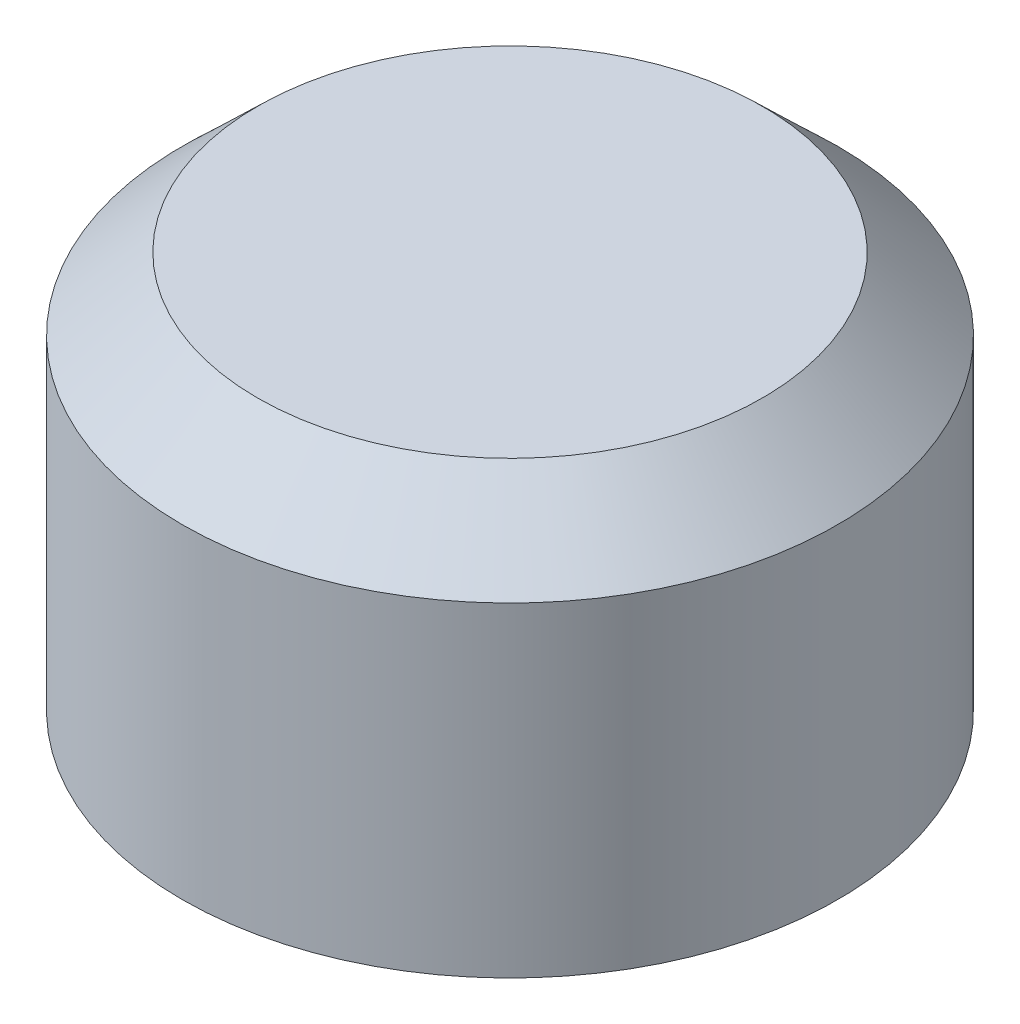
ISO-10303-21;
HEADER;
FILE_DESCRIPTION(('STEP AP214'),'2;1');
FILE_NAME('part.step','',(''),(''),'','','');
FILE_SCHEMA(('AUTOMOTIVE_DESIGN { 1 0 10303 214 1 1 1 1 }'));
ENDSEC;
DATA;
#1=APPLICATION_CONTEXT('core data for automotive mechanical design processes');
#2=APPLICATION_PROTOCOL_DEFINITION('international standard','automotive_design',2000,#1);
#3=PRODUCT_CONTEXT('',#1,'mechanical');
#4=PRODUCT('Part','Part','',(#3));
#5=PRODUCT_RELATED_PRODUCT_CATEGORY('part','',(#4));
#6=PRODUCT_DEFINITION_FORMATION('','',#4);
#7=PRODUCT_DEFINITION_CONTEXT('part definition',#1,'design');
#8=PRODUCT_DEFINITION('design','',#6,#7);
#9=PRODUCT_DEFINITION_SHAPE('','',#8);
#10=(LENGTH_UNIT() NAMED_UNIT(*) SI_UNIT(.MILLI.,.METRE.));
#11=(NAMED_UNIT(*) PLANE_ANGLE_UNIT() SI_UNIT($,.RADIAN.));
#12=(NAMED_UNIT(*) SI_UNIT($,.STERADIAN.) SOLID_ANGLE_UNIT());
#13=UNCERTAINTY_MEASURE_WITH_UNIT(LENGTH_MEASURE(1.E-05),#10,'distance_accuracy_value','');
#14=(GEOMETRIC_REPRESENTATION_CONTEXT(3) GLOBAL_UNCERTAINTY_ASSIGNED_CONTEXT((#13)) GLOBAL_UNIT_ASSIGNED_CONTEXT((#10,
#11,#12)) REPRESENTATION_CONTEXT('',''));
#15=CARTESIAN_POINT('',(0.,0.,0.));
#16=DIRECTION('',(0.,0.,1.));
#17=DIRECTION('',(1.,0.,0.));
#18=AXIS2_PLACEMENT_3D('',#15,#16,#17);
#19=CARTESIAN_POINT('',(0.,3520.44,0.));
#20=DIRECTION('',(0.,1.,0.));
#21=DIRECTION('',(0.,0.,1.));
#22=AXIS2_PLACEMENT_3D('',#19,#20,#21);
#23=CYLINDRICAL_SURFACE('',#22,2743.2);
#24=CARTESIAN_POINT('',(0.,2732.37406594724,0.));
#25=DIRECTION('',(0.,1.,0.));
#26=DIRECTION('',(0.,0.,1.));
#27=AXIS2_PLACEMENT_3D('',#24,#25,#26);
#28=CIRCLE('',#27,2743.2);
#29=CARTESIAN_POINT('',(0.,2732.37406594724,2743.2));
#30=VERTEX_POINT('',#29);
#31=EDGE_CURVE('E72',#30,#30,#28,.T.);
#32=ORIENTED_EDGE('',*,*,#31,.T.);
#33=EDGE_LOOP('',(#32));
#34=FACE_BOUND('',#33,.T.);
#35=CARTESIAN_POINT('',(0.,0.,0.));
#36=DIRECTION('',(0.,1.,0.));
#37=DIRECTION('',(0.,0.,1.));
#38=AXIS2_PLACEMENT_3D('',#35,#36,#37);
#39=CIRCLE('',#38,2743.2);
#40=CARTESIAN_POINT('',(0.,0.,2743.2));
#41=VERTEX_POINT('',#40);
#42=EDGE_CURVE('E11',#41,#41,#39,.T.);
#43=ORIENTED_EDGE('',*,*,#42,.F.);
#44=EDGE_LOOP('',(#43));
#45=FACE_BOUND('',#44,.T.);
#46=ADVANCED_FACE('F45',(#34,#45),#23,.F.);
#47=CARTESIAN_POINT('',(-2743.2,0.,0.));
#48=DIRECTION('',(0.,-1.,0.));
#49=DIRECTION('',(0.,0.,-1.));
#50=AXIS2_PLACEMENT_3D('',#47,#48,#49);
#51=PLANE('',#50);
#52=ORIENTED_EDGE('',*,*,#42,.T.);
#53=EDGE_LOOP('',(#52));
#54=FACE_BOUND('',#53,.T.);
#55=CARTESIAN_POINT('',(0.,0.,0.));
#56=DIRECTION('',(0.,1.,0.));
#57=DIRECTION('',(0.,0.,1.));
#58=AXIS2_PLACEMENT_3D('',#55,#56,#57);
#59=CIRCLE('',#58,2768.6);
#60=CARTESIAN_POINT('',(0.,0.,2768.6));
#61=VERTEX_POINT('',#60);
#62=EDGE_CURVE('E52',#61,#61,#59,.T.);
#63=ORIENTED_EDGE('',*,*,#62,.F.);
#64=EDGE_LOOP('',(#63));
#65=FACE_BOUND('',#64,.T.);
#66=ADVANCED_FACE('F91',(#54,#65),#51,.T.);
#67=CARTESIAN_POINT('',(0.,3520.44,0.));
#68=DIRECTION('',(0.,1.,0.));
#69=DIRECTION('',(0.,0.,1.));
#70=AXIS2_PLACEMENT_3D('',#67,#68,#69);
#71=CYLINDRICAL_SURFACE('',#70,2768.6);
#72=ORIENTED_EDGE('',*,*,#62,.T.);
#73=EDGE_LOOP('',(#72));
#74=FACE_BOUND('',#73,.T.);
#75=CARTESIAN_POINT('',(0.,2743.2,0.));
#76=DIRECTION('',(0.,1.,0.));
#77=DIRECTION('',(0.,0.,1.));
#78=AXIS2_PLACEMENT_3D('',#75,#76,#77);
#79=CIRCLE('',#78,2768.6);
#80=CARTESIAN_POINT('',(0.,2743.2,2768.6));
#81=VERTEX_POINT('',#80);
#82=EDGE_CURVE('E57',#81,#81,#79,.T.);
#83=ORIENTED_EDGE('',*,*,#82,.F.);
#84=EDGE_LOOP('',(#83));
#85=FACE_BOUND('',#84,.T.);
#86=ADVANCED_FACE('F95',(#74,#85),#71,.T.);
#87=CARTESIAN_POINT('',(0.,3352.8,0.));
#88=DIRECTION('',(0.,-1.,0.));
#89=DIRECTION('',(0.,0.,-1.));
#90=AXIS2_PLACEMENT_3D('',#87,#88,#89);
#91=CONICAL_SURFACE('',#90,2133.6,0.805803494083987);
#92=ORIENTED_EDGE('',*,*,#82,.T.);
#93=EDGE_LOOP('',(#92));
#94=FACE_BOUND('',#93,.T.);
#95=CARTESIAN_POINT('',(0.,3352.8,0.));
#96=DIRECTION('',(0.,1.,0.));
#97=DIRECTION('',(0.,0.,1.));
#98=AXIS2_PLACEMENT_3D('',#95,#96,#97);
#99=CIRCLE('',#98,2133.6);
#100=CARTESIAN_POINT('',(0.,3352.8,2133.6));
#101=VERTEX_POINT('',#100);
#102=EDGE_CURVE('E62',#101,#101,#99,.T.);
#103=ORIENTED_EDGE('',*,*,#102,.F.);
#104=EDGE_LOOP('',(#103));
#105=FACE_BOUND('',#104,.T.);
#106=ADVANCED_FACE('F99',(#94,#105),#91,.T.);
#107=CARTESIAN_POINT('',(0.,3352.8,0.));
#108=DIRECTION('',(0.,1.,0.));
#109=DIRECTION('',(0.,0.,1.));
#110=AXIS2_PLACEMENT_3D('',#107,#108,#109);
#111=PLANE('',#110);
#112=ORIENTED_EDGE('',*,*,#102,.T.);
#113=EDGE_LOOP('',(#112));
#114=FACE_BOUND('',#113,.T.);
#115=ADVANCED_FACE('F87',(#114),#111,.T.);
#116=CARTESIAN_POINT('',(-2123.38131869504,3327.4,0.));
#117=DIRECTION('',(0.,-1.,0.));
#118=DIRECTION('',(0.,0.,-1.));
#119=AXIS2_PLACEMENT_3D('',#116,#117,#118);
#120=PLANE('',#119);
#121=CARTESIAN_POINT('',(0.,3327.4,0.));
#122=DIRECTION('',(0.,1.,0.));
#123=DIRECTION('',(0.,0.,1.));
#124=AXIS2_PLACEMENT_3D('',#121,#122,#123);
#125=CIRCLE('',#124,2123.38131869504);
#126=CARTESIAN_POINT('',(0.,3327.4,2123.38131869504));
#127=VERTEX_POINT('',#126);
#128=EDGE_CURVE('E68',#127,#127,#125,.T.);
#129=ORIENTED_EDGE('',*,*,#128,.F.);
#130=EDGE_LOOP('',(#129));
#131=FACE_BOUND('',#130,.T.);
#132=ADVANCED_FACE('F81',(#131),#120,.T.);
#133=CARTESIAN_POINT('',(0.,2732.37406594724,0.));
#134=DIRECTION('',(0.,-1.,0.));
#135=DIRECTION('',(0.,0.,-1.));
#136=AXIS2_PLACEMENT_3D('',#133,#134,#135);
#137=CONICAL_SURFACE('',#136,2743.2,0.805803494083986);
#138=ORIENTED_EDGE('',*,*,#128,.T.);
#139=EDGE_LOOP('',(#138));
#140=FACE_BOUND('',#139,.T.);
#141=ORIENTED_EDGE('',*,*,#31,.F.);
#142=EDGE_LOOP('',(#141));
#143=FACE_BOUND('',#142,.T.);
#144=ADVANCED_FACE('F79',(#140,#143),#137,.F.);
#145=CLOSED_SHELL('',(#46,#66,#86,#106,#115,#132,#144));
#146=MANIFOLD_SOLID_BREP('B2',#145);
#147=CARTESIAN_POINT('',(-2413.,0.,0.));
#148=DIRECTION('',(0.,-1.,0.));
#149=DIRECTION('',(0.,0.,-1.));
#150=AXIS2_PLACEMENT_3D('',#147,#148,#149);
#151=PLANE('',#150);
#152=CARTESIAN_POINT('',(0.,0.,0.));
#153=DIRECTION('',(0.,1.,0.));
#154=DIRECTION('',(0.,0.,1.));
#155=AXIS2_PLACEMENT_3D('',#152,#153,#154);
#156=CIRCLE('',#155,2413.);
#157=CARTESIAN_POINT('',(0.,0.,2413.));
#158=VERTEX_POINT('',#157);
#159=EDGE_CURVE('E198',#158,#158,#156,.T.);
#160=ORIENTED_EDGE('',*,*,#159,.T.);
#161=EDGE_LOOP('',(#160));
#162=FACE_BOUND('',#161,.T.);
#163=CARTESIAN_POINT('',(0.,0.,0.));
#164=DIRECTION('',(0.,1.,0.));
#165=DIRECTION('',(0.,0.,1.));
#166=AXIS2_PLACEMENT_3D('',#163,#164,#165);
#167=CIRCLE('',#166,2438.4);
#168=CARTESIAN_POINT('',(0.,0.,2438.4));
#169=VERTEX_POINT('',#168);
#170=EDGE_CURVE('E44',#169,#169,#167,.T.);
#171=ORIENTED_EDGE('',*,*,#170,.F.);
#172=EDGE_LOOP('',(#171));
#173=FACE_BOUND('',#172,.T.);
#174=ADVANCED_FACE('F152',(#162,#173),#151,.T.);
#175=CARTESIAN_POINT('',(0.,3520.44,0.));
#176=DIRECTION('',(0.,1.,0.));
#177=DIRECTION('',(0.,0.,1.));
#178=AXIS2_PLACEMENT_3D('',#175,#176,#177);
#179=CYLINDRICAL_SURFACE('',#178,2438.4);
#180=ORIENTED_EDGE('',*,*,#170,.T.);
#181=EDGE_LOOP('',(#180));
#182=FACE_BOUND('',#181,.T.);
#183=CARTESIAN_POINT('',(0.,2753.72102448428,0.));
#184=DIRECTION('',(0.,1.,0.));
#185=DIRECTION('',(0.,0.,1.));
#186=AXIS2_PLACEMENT_3D('',#183,#184,#185);
#187=CIRCLE('',#186,2438.4);
#188=CARTESIAN_POINT('',(0.,2753.72102448428,2438.4));
#189=VERTEX_POINT('',#188);
#190=EDGE_CURVE('E158',#189,#189,#187,.T.);
#191=ORIENTED_EDGE('',*,*,#190,.F.);
#192=EDGE_LOOP('',(#191));
#193=FACE_BOUND('',#192,.T.);
#194=ADVANCED_FACE('F216',(#182,#193),#179,.T.);
#195=CARTESIAN_POINT('',(0.,3073.4,0.));
#196=DIRECTION('',(0.,-1.,0.));
#197=DIRECTION('',(0.,0.,-1.));
#198=AXIS2_PLACEMENT_3D('',#195,#196,#197);
#199=CONICAL_SURFACE('',#198,2118.72102448428,0.785398163397448);
#200=ORIENTED_EDGE('',*,*,#190,.T.);
#201=EDGE_LOOP('',(#200));
#202=FACE_BOUND('',#201,.T.);
#203=CARTESIAN_POINT('',(0.,3073.4,0.));
#204=DIRECTION('',(0.,1.,0.));
#205=DIRECTION('',(0.,0.,1.));
#206=AXIS2_PLACEMENT_3D('',#203,#204,#205);
#207=CIRCLE('',#206,2118.72102448428);
#208=CARTESIAN_POINT('',(0.,3073.4,2118.72102448428));
#209=VERTEX_POINT('',#208);
#210=EDGE_CURVE('E162',#209,#209,#207,.T.);
#211=ORIENTED_EDGE('',*,*,#210,.F.);
#212=EDGE_LOOP('',(#211));
#213=FACE_BOUND('',#212,.T.);
#214=ADVANCED_FACE('F220',(#202,#213),#199,.T.);
#215=CARTESIAN_POINT('',(-2118.72102448428,3073.4,0.));
#216=DIRECTION('',(0.,1.,0.));
#217=DIRECTION('',(0.,0.,1.));
#218=AXIS2_PLACEMENT_3D('',#215,#216,#217);
#219=PLANE('',#218);
#220=ORIENTED_EDGE('',*,*,#210,.T.);
#221=EDGE_LOOP('',(#220));
#222=FACE_BOUND('',#221,.T.);
#223=CARTESIAN_POINT('',(0.,3073.4,0.));
#224=DIRECTION('',(0.,1.,0.));
#225=DIRECTION('',(0.,0.,1.));
#226=AXIS2_PLACEMENT_3D('',#223,#224,#225);
#227=CIRCLE('',#226,1190.87720649982);
#228=CARTESIAN_POINT('',(0.,3073.4,1190.87720649982));
#229=VERTEX_POINT('',#228);
#230=EDGE_CURVE('E166',#229,#229,#227,.T.);
#231=ORIENTED_EDGE('',*,*,#230,.F.);
#232=EDGE_LOOP('',(#231));
#233=FACE_BOUND('',#232,.T.);
#234=ADVANCED_FACE('F224',(#222,#233),#219,.T.);
#235=CARTESIAN_POINT('',(0.,2796.92279350018,0.));
#236=DIRECTION('',(0.,1.,0.));
#237=DIRECTION('',(0.,0.,1.));
#238=AXIS2_PLACEMENT_3D('',#235,#236,#237);
#239=CONICAL_SURFACE('',#238,914.400000000001,0.785398163397449);
#240=ORIENTED_EDGE('',*,*,#230,.T.);
#241=EDGE_LOOP('',(#240));
#242=FACE_BOUND('',#241,.T.);
#243=CARTESIAN_POINT('',(0.,2796.92279350018,0.));
#244=DIRECTION('',(0.,1.,0.));
#245=DIRECTION('',(0.,0.,1.));
#246=AXIS2_PLACEMENT_3D('',#243,#244,#245);
#247=CIRCLE('',#246,914.400000000001);
#248=CARTESIAN_POINT('',(0.,2796.92279350018,914.400000000001));
#249=VERTEX_POINT('',#248);
#250=EDGE_CURVE('E171',#249,#249,#247,.T.);
#251=ORIENTED_EDGE('',*,*,#250,.F.);
#252=EDGE_LOOP('',(#251));
#253=FACE_BOUND('',#252,.T.);
#254=ADVANCED_FACE('F230',(#242,#253),#239,.F.);
#255=CARTESIAN_POINT('',(0.,3520.44,0.));
#256=DIRECTION('',(0.,1.,0.));
#257=DIRECTION('',(0.,0.,1.));
#258=AXIS2_PLACEMENT_3D('',#255,#256,#257);
#259=CYLINDRICAL_SURFACE('',#258,914.4);
#260=ORIENTED_EDGE('',*,*,#250,.T.);
#261=EDGE_LOOP('',(#260));
#262=FACE_BOUND('',#261,.T.);
#263=CARTESIAN_POINT('',(0.,2074.,0.));
#264=DIRECTION('',(0.,1.,0.));
#265=DIRECTION('',(0.,0.,1.));
#266=AXIS2_PLACEMENT_3D('',#263,#264,#265);
#267=CIRCLE('',#266,914.4);
#268=CARTESIAN_POINT('',(0.,2074.,914.4));
#269=VERTEX_POINT('',#268);
#270=EDGE_CURVE('E174',#269,#269,#267,.T.);
#271=ORIENTED_EDGE('',*,*,#270,.F.);
#272=EDGE_LOOP('',(#271));
#273=FACE_BOUND('',#272,.T.);
#274=ADVANCED_FACE('F234',(#262,#273),#259,.F.);
#275=CARTESIAN_POINT('',(0.,1523.74040468015,0.));
#276=DIRECTION('',(0.,1.,0.));
#277=DIRECTION('',(0.,0.,1.));
#278=AXIS2_PLACEMENT_3D('',#275,#276,#277);
#279=CONICAL_SURFACE('',#278,364.140404680152,0.78539816339745);
#280=ORIENTED_EDGE('',*,*,#270,.T.);
#281=EDGE_LOOP('',(#280));
#282=FACE_BOUND('',#281,.T.);
#283=CARTESIAN_POINT('',(0.,1523.74040468015,0.));
#284=DIRECTION('',(0.,1.,0.));
#285=DIRECTION('',(0.,0.,1.));
#286=AXIS2_PLACEMENT_3D('',#283,#284,#285);
#287=CIRCLE('',#286,364.140404680152);
#288=CARTESIAN_POINT('',(0.,1523.74040468015,364.140404680152));
#289=VERTEX_POINT('',#288);
#290=EDGE_CURVE('E177',#289,#289,#287,.T.);
#291=ORIENTED_EDGE('',*,*,#290,.F.);
#292=EDGE_LOOP('',(#291));
#293=FACE_BOUND('',#292,.T.);
#294=ADVANCED_FACE('F238',(#282,#293),#279,.F.);
#295=CARTESIAN_POINT('',(-364.140404680152,1523.74040468015,0.));
#296=DIRECTION('',(0.,-1.,0.));
#297=DIRECTION('',(0.,0.,-1.));
#298=AXIS2_PLACEMENT_3D('',#295,#296,#297);
#299=PLANE('',#298);
#300=ORIENTED_EDGE('',*,*,#290,.T.);
#301=EDGE_LOOP('',(#300));
#302=FACE_BOUND('',#301,.T.);
#303=CARTESIAN_POINT('',(0.,1523.74040468015,0.));
#304=DIRECTION('',(0.,1.,0.));
#305=DIRECTION('',(0.,0.,1.));
#306=AXIS2_PLACEMENT_3D('',#303,#304,#305);
#307=CIRCLE('',#306,389.540404680152);
#308=CARTESIAN_POINT('',(0.,1523.74040468015,389.540404680152));
#309=VERTEX_POINT('',#308);
#310=EDGE_CURVE('E180',#309,#309,#307,.T.);
#311=ORIENTED_EDGE('',*,*,#310,.F.);
#312=EDGE_LOOP('',(#311));
#313=FACE_BOUND('',#312,.T.);
#314=ADVANCED_FACE('F242',(#302,#313),#299,.T.);
#315=CARTESIAN_POINT('',(0.,2074.,0.));
#316=DIRECTION('',(0.,1.,0.));
#317=DIRECTION('',(0.,0.,1.));
#318=AXIS2_PLACEMENT_3D('',#315,#316,#317);
#319=CONICAL_SURFACE('',#318,939.800000000001,0.785398163397452);
#320=ORIENTED_EDGE('',*,*,#310,.T.);
#321=EDGE_LOOP('',(#320));
#322=FACE_BOUND('',#321,.T.);
#323=CARTESIAN_POINT('',(0.,2074.,0.));
#324=DIRECTION('',(0.,1.,0.));
#325=DIRECTION('',(0.,0.,1.));
#326=AXIS2_PLACEMENT_3D('',#323,#324,#325);
#327=CIRCLE('',#326,939.800000000001);
#328=CARTESIAN_POINT('',(0.,2074.,939.800000000001));
#329=VERTEX_POINT('',#328);
#330=EDGE_CURVE('E183',#329,#329,#327,.T.);
#331=ORIENTED_EDGE('',*,*,#330,.F.);
#332=EDGE_LOOP('',(#331));
#333=FACE_BOUND('',#332,.T.);
#334=ADVANCED_FACE('F246',(#322,#333),#319,.T.);
#335=CARTESIAN_POINT('',(0.,3520.44,0.));
#336=DIRECTION('',(0.,1.,0.));
#337=DIRECTION('',(0.,0.,1.));
#338=AXIS2_PLACEMENT_3D('',#335,#336,#337);
#339=CYLINDRICAL_SURFACE('',#338,939.8);
#340=ORIENTED_EDGE('',*,*,#330,.T.);
#341=EDGE_LOOP('',(#340));
#342=FACE_BOUND('',#341,.T.);
#343=CARTESIAN_POINT('',(0.,2786.4017690159,0.));
#344=DIRECTION('',(0.,1.,0.));
#345=DIRECTION('',(0.,0.,1.));
#346=AXIS2_PLACEMENT_3D('',#343,#344,#345);
#347=CIRCLE('',#346,939.8);
#348=CARTESIAN_POINT('',(0.,2786.4017690159,939.8));
#349=VERTEX_POINT('',#348);
#350=EDGE_CURVE('E186',#349,#349,#347,.T.);
#351=ORIENTED_EDGE('',*,*,#350,.F.);
#352=EDGE_LOOP('',(#351));
#353=FACE_BOUND('',#352,.T.);
#354=ADVANCED_FACE('F250',(#342,#353),#339,.T.);
#355=CARTESIAN_POINT('',(0.,3048.,0.));
#356=DIRECTION('',(0.,1.,0.));
#357=DIRECTION('',(0.,0.,1.));
#358=AXIS2_PLACEMENT_3D('',#355,#356,#357);
#359=CONICAL_SURFACE('',#358,1201.3982309841,0.785398163397449);
#360=ORIENTED_EDGE('',*,*,#350,.T.);
#361=EDGE_LOOP('',(#360));
#362=FACE_BOUND('',#361,.T.);
#363=CARTESIAN_POINT('',(0.,3048.,0.));
#364=DIRECTION('',(0.,1.,0.));
#365=DIRECTION('',(0.,0.,1.));
#366=AXIS2_PLACEMENT_3D('',#363,#364,#365);
#367=CIRCLE('',#366,1201.3982309841);
#368=CARTESIAN_POINT('',(0.,3048.,1201.3982309841));
#369=VERTEX_POINT('',#368);
#370=EDGE_CURVE('E189',#369,#369,#367,.T.);
#371=ORIENTED_EDGE('',*,*,#370,.F.);
#372=EDGE_LOOP('',(#371));
#373=FACE_BOUND('',#372,.T.);
#374=ADVANCED_FACE('F254',(#362,#373),#359,.T.);
#375=CARTESIAN_POINT('',(-1201.3982309841,3048.,0.));
#376=DIRECTION('',(0.,-1.,0.));
#377=DIRECTION('',(0.,0.,-1.));
#378=AXIS2_PLACEMENT_3D('',#375,#376,#377);
#379=PLANE('',#378);
#380=ORIENTED_EDGE('',*,*,#370,.T.);
#381=EDGE_LOOP('',(#380));
#382=FACE_BOUND('',#381,.T.);
#383=CARTESIAN_POINT('',(0.,3048.,0.));
#384=DIRECTION('',(0.,1.,0.));
#385=DIRECTION('',(0.,0.,1.));
#386=AXIS2_PLACEMENT_3D('',#383,#384,#385);
#387=CIRCLE('',#386,2108.2);
#388=CARTESIAN_POINT('',(0.,3048.,2108.2));
#389=VERTEX_POINT('',#388);
#390=EDGE_CURVE('E192',#389,#389,#387,.T.);
#391=ORIENTED_EDGE('',*,*,#390,.F.);
#392=EDGE_LOOP('',(#391));
#393=FACE_BOUND('',#392,.T.);
#394=ADVANCED_FACE('F212',(#382,#393),#379,.T.);
#395=CARTESIAN_POINT('',(0.,2743.2,0.));
#396=DIRECTION('',(0.,-1.,0.));
#397=DIRECTION('',(0.,0.,-1.));
#398=AXIS2_PLACEMENT_3D('',#395,#396,#397);
#399=CONICAL_SURFACE('',#398,2413.,0.785398163397448);
#400=ORIENTED_EDGE('',*,*,#390,.T.);
#401=EDGE_LOOP('',(#400));
#402=FACE_BOUND('',#401,.T.);
#403=CARTESIAN_POINT('',(0.,2743.2,0.));
#404=DIRECTION('',(0.,1.,0.));
#405=DIRECTION('',(0.,0.,1.));
#406=AXIS2_PLACEMENT_3D('',#403,#404,#405);
#407=CIRCLE('',#406,2413.);
#408=CARTESIAN_POINT('',(0.,2743.2,2413.));
#409=VERTEX_POINT('',#408);
#410=EDGE_CURVE('E195',#409,#409,#407,.T.);
#411=ORIENTED_EDGE('',*,*,#410,.F.);
#412=EDGE_LOOP('',(#411));
#413=FACE_BOUND('',#412,.T.);
#414=ADVANCED_FACE('F206',(#402,#413),#399,.F.);
#415=CARTESIAN_POINT('',(0.,3520.44,0.));
#416=DIRECTION('',(0.,1.,0.));
#417=DIRECTION('',(0.,0.,1.));
#418=AXIS2_PLACEMENT_3D('',#415,#416,#417);
#419=CYLINDRICAL_SURFACE('',#418,2413.);
#420=ORIENTED_EDGE('',*,*,#410,.T.);
#421=EDGE_LOOP('',(#420));
#422=FACE_BOUND('',#421,.T.);
#423=ORIENTED_EDGE('',*,*,#159,.F.);
#424=EDGE_LOOP('',(#423));
#425=FACE_BOUND('',#424,.T.);
#426=ADVANCED_FACE('F204',(#422,#425),#419,.F.);
#427=CLOSED_SHELL('',(#174,#194,#214,#234,#254,#274,#294,#314,#334,#354,#374,#394,#414,#426));
#428=MANIFOLD_SOLID_BREP('B6',#427);
#429=ADVANCED_BREP_SHAPE_REPRESENTATION('',(#18,#146,#428),#14);
#430=SHAPE_DEFINITION_REPRESENTATION(#9,#429);
ENDSEC;
END-ISO-10303-21;
